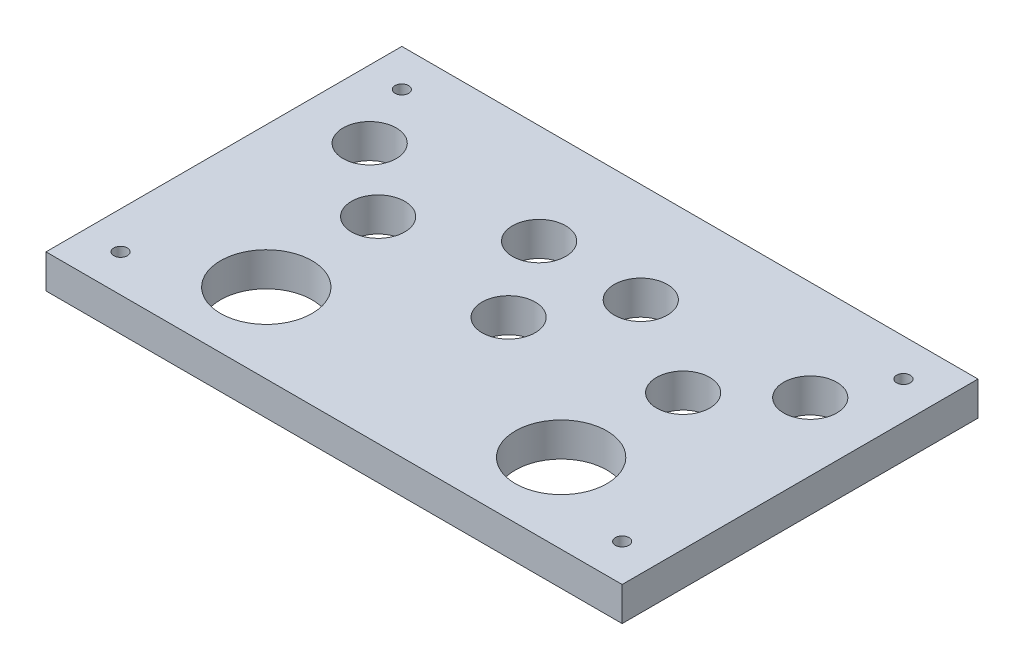
ISO-10303-21;
HEADER;
FILE_DESCRIPTION(('STEP AP214'),'2;1');
FILE_NAME('part.step','',(''),(''),'','','');
FILE_SCHEMA(('AUTOMOTIVE_DESIGN { 1 0 10303 214 1 1 1 1 }'));
ENDSEC;
DATA;
#1=APPLICATION_CONTEXT('core data for automotive mechanical design processes');
#2=APPLICATION_PROTOCOL_DEFINITION('international standard','automotive_design',2000,#1);
#3=PRODUCT_CONTEXT('',#1,'mechanical');
#4=PRODUCT('Part','Part','',(#3));
#5=PRODUCT_RELATED_PRODUCT_CATEGORY('part','',(#4));
#6=PRODUCT_DEFINITION_FORMATION('','',#4);
#7=PRODUCT_DEFINITION_CONTEXT('part definition',#1,'design');
#8=PRODUCT_DEFINITION('design','',#6,#7);
#9=PRODUCT_DEFINITION_SHAPE('','',#8);
#10=(LENGTH_UNIT() NAMED_UNIT(*) SI_UNIT(.MILLI.,.METRE.));
#11=(NAMED_UNIT(*) PLANE_ANGLE_UNIT() SI_UNIT($,.RADIAN.));
#12=(NAMED_UNIT(*) SI_UNIT($,.STERADIAN.) SOLID_ANGLE_UNIT());
#13=UNCERTAINTY_MEASURE_WITH_UNIT(LENGTH_MEASURE(1.E-05),#10,'distance_accuracy_value','');
#14=(GEOMETRIC_REPRESENTATION_CONTEXT(3) GLOBAL_UNCERTAINTY_ASSIGNED_CONTEXT((#13)) GLOBAL_UNIT_ASSIGNED_CONTEXT((#10,
#11,#12)) REPRESENTATION_CONTEXT('',''));
#15=CARTESIAN_POINT('',(0.,0.,0.));
#16=DIRECTION('',(0.,0.,1.));
#17=DIRECTION('',(1.,0.,0.));
#18=AXIS2_PLACEMENT_3D('',#15,#16,#17);
#19=CARTESIAN_POINT('',(0.,10.,0.));
#20=DIRECTION('',(0.,0.,-1.));
#21=DIRECTION('',(-1.,0.,0.));
#22=AXIS2_PLACEMENT_3D('',#19,#20,#21);
#23=PLANE('',#22);
#24=DIRECTION('',(1.,0.,0.));
#25=VECTOR('',#24,1.);
#26=CARTESIAN_POINT('',(0.,0.,0.));
#27=LINE('',#26,#25);
#28=CARTESIAN_POINT('',(0.,0.,0.));
#29=VERTEX_POINT('',#28);
#30=CARTESIAN_POINT('',(170.,0.,0.));
#31=VERTEX_POINT('',#30);
#32=EDGE_CURVE('E139',#29,#31,#27,.T.);
#33=ORIENTED_EDGE('',*,*,#32,.T.);
#34=DIRECTION('',(0.,-1.,0.));
#35=VECTOR('',#34,1.);
#36=CARTESIAN_POINT('',(170.,10.,0.));
#37=LINE('',#36,#35);
#38=CARTESIAN_POINT('',(170.,10.,0.));
#39=VERTEX_POINT('',#38);
#40=EDGE_CURVE('E11',#39,#31,#37,.T.);
#41=ORIENTED_EDGE('',*,*,#40,.F.);
#42=DIRECTION('',(1.,0.,0.));
#43=VECTOR('',#42,1.);
#44=CARTESIAN_POINT('',(0.,10.,0.));
#45=LINE('',#44,#43);
#46=CARTESIAN_POINT('',(0.,10.,0.));
#47=VERTEX_POINT('',#46);
#48=EDGE_CURVE('E86',#47,#39,#45,.T.);
#49=ORIENTED_EDGE('',*,*,#48,.F.);
#50=DIRECTION('',(0.,-1.,0.));
#51=VECTOR('',#50,1.);
#52=CARTESIAN_POINT('',(0.,10.,0.));
#53=LINE('',#52,#51);
#54=EDGE_CURVE('E52',#47,#29,#53,.T.);
#55=ORIENTED_EDGE('',*,*,#54,.T.);
#56=EDGE_LOOP('',(#33,#41,#49,#55));
#57=FACE_BOUND('',#56,.T.);
#58=ADVANCED_FACE('F35',(#57),#23,.F.);
#59=CARTESIAN_POINT('',(170.,10.,0.));
#60=DIRECTION('',(-1.,0.,0.));
#61=DIRECTION('',(0.,0.,1.));
#62=AXIS2_PLACEMENT_3D('',#59,#60,#61);
#63=PLANE('',#62);
#64=DIRECTION('',(0.,0.,-1.));
#65=VECTOR('',#64,1.);
#66=CARTESIAN_POINT('',(170.,0.,0.));
#67=LINE('',#66,#65);
#68=CARTESIAN_POINT('',(170.,0.,-105.));
#69=VERTEX_POINT('',#68);
#70=EDGE_CURVE('E91',#31,#69,#67,.T.);
#71=ORIENTED_EDGE('',*,*,#70,.T.);
#72=DIRECTION('',(0.,-1.,0.));
#73=VECTOR('',#72,1.);
#74=CARTESIAN_POINT('',(170.,10.,-105.));
#75=LINE('',#74,#73);
#76=CARTESIAN_POINT('',(170.,10.,-105.));
#77=VERTEX_POINT('',#76);
#78=EDGE_CURVE('E44',#77,#69,#75,.T.);
#79=ORIENTED_EDGE('',*,*,#78,.F.);
#80=DIRECTION('',(0.,0.,-1.));
#81=VECTOR('',#80,1.);
#82=CARTESIAN_POINT('',(170.,10.,0.));
#83=LINE('',#82,#81);
#84=EDGE_CURVE('E77',#39,#77,#83,.T.);
#85=ORIENTED_EDGE('',*,*,#84,.F.);
#86=ORIENTED_EDGE('',*,*,#40,.T.);
#87=EDGE_LOOP('',(#71,#79,#85,#86));
#88=FACE_BOUND('',#87,.T.);
#89=ADVANCED_FACE('F90',(#88),#63,.F.);
#90=CARTESIAN_POINT('',(0.,10.,-105.));
#91=DIRECTION('',(0.,0.,-1.));
#92=DIRECTION('',(-1.,0.,0.));
#93=AXIS2_PLACEMENT_3D('',#90,#91,#92);
#94=PLANE('',#93);
#95=DIRECTION('',(1.,0.,0.));
#96=VECTOR('',#95,1.);
#97=CARTESIAN_POINT('',(0.,0.,-105.));
#98=LINE('',#97,#96);
#99=CARTESIAN_POINT('',(0.,0.,-105.));
#100=VERTEX_POINT('',#99);
#101=EDGE_CURVE('E142',#100,#69,#98,.T.);
#102=ORIENTED_EDGE('',*,*,#101,.F.);
#103=DIRECTION('',(0.,-1.,0.));
#104=VECTOR('',#103,1.);
#105=CARTESIAN_POINT('',(0.,10.,-105.));
#106=LINE('',#105,#104);
#107=CARTESIAN_POINT('',(0.,10.,-105.));
#108=VERTEX_POINT('',#107);
#109=EDGE_CURVE('E66',#108,#100,#106,.T.);
#110=ORIENTED_EDGE('',*,*,#109,.F.);
#111=DIRECTION('',(1.,0.,0.));
#112=VECTOR('',#111,1.);
#113=CARTESIAN_POINT('',(0.,10.,-105.));
#114=LINE('',#113,#112);
#115=EDGE_CURVE('E85',#108,#77,#114,.T.);
#116=ORIENTED_EDGE('',*,*,#115,.T.);
#117=ORIENTED_EDGE('',*,*,#78,.T.);
#118=EDGE_LOOP('',(#102,#110,#116,#117));
#119=FACE_BOUND('',#118,.T.);
#120=ADVANCED_FACE('F94',(#119),#94,.T.);
#121=CARTESIAN_POINT('',(70.,10.,-75.5));
#122=DIRECTION('',(0.,-1.,0.));
#123=DIRECTION('',(0.,0.,-1.));
#124=AXIS2_PLACEMENT_3D('',#121,#122,#123);
#125=CYLINDRICAL_SURFACE('',#124,7.84999999999999);
#126=CARTESIAN_POINT('',(70.,10.,-75.5));
#127=DIRECTION('',(0.,1.,0.));
#128=DIRECTION('',(0.,0.,1.));
#129=AXIS2_PLACEMENT_3D('',#126,#127,#128);
#130=CIRCLE('',#129,7.84999999999999);
#131=CARTESIAN_POINT('',(70.,10.,-67.65));
#132=VERTEX_POINT('',#131);
#133=EDGE_CURVE('E118',#132,#132,#130,.T.);
#134=ORIENTED_EDGE('',*,*,#133,.T.);
#135=EDGE_LOOP('',(#134));
#136=FACE_BOUND('',#135,.T.);
#137=CARTESIAN_POINT('',(70.,0.,-75.5));
#138=DIRECTION('',(0.,1.,0.));
#139=DIRECTION('',(0.,0.,1.));
#140=AXIS2_PLACEMENT_3D('',#137,#138,#139);
#141=CIRCLE('',#140,7.84999999999999);
#142=CARTESIAN_POINT('',(70.,0.,-67.65));
#143=VERTEX_POINT('',#142);
#144=EDGE_CURVE('E165',#143,#143,#141,.T.);
#145=ORIENTED_EDGE('',*,*,#144,.F.);
#146=EDGE_LOOP('',(#145));
#147=FACE_BOUND('',#146,.T.);
#148=ADVANCED_FACE('F260',(#136,#147),#125,.F.);
#149=CARTESIAN_POINT('',(40.,10.,-58.));
#150=DIRECTION('',(0.,-1.,0.));
#151=DIRECTION('',(0.,0.,-1.));
#152=AXIS2_PLACEMENT_3D('',#149,#150,#151);
#153=CYLINDRICAL_SURFACE('',#152,7.84999999999999);
#154=CARTESIAN_POINT('',(40.,10.,-58.));
#155=DIRECTION('',(0.,1.,0.));
#156=DIRECTION('',(0.,0.,1.));
#157=AXIS2_PLACEMENT_3D('',#154,#155,#156);
#158=CIRCLE('',#157,7.84999999999999);
#159=CARTESIAN_POINT('',(40.,10.,-50.15));
#160=VERTEX_POINT('',#159);
#161=EDGE_CURVE('E115',#160,#160,#158,.T.);
#162=ORIENTED_EDGE('',*,*,#161,.T.);
#163=EDGE_LOOP('',(#162));
#164=FACE_BOUND('',#163,.T.);
#165=CARTESIAN_POINT('',(40.,0.,-58.));
#166=DIRECTION('',(0.,1.,0.));
#167=DIRECTION('',(0.,0.,1.));
#168=AXIS2_PLACEMENT_3D('',#165,#166,#167);
#169=CIRCLE('',#168,7.84999999999999);
#170=CARTESIAN_POINT('',(40.,0.,-50.15));
#171=VERTEX_POINT('',#170);
#172=EDGE_CURVE('E162',#171,#171,#169,.T.);
#173=ORIENTED_EDGE('',*,*,#172,.F.);
#174=EDGE_LOOP('',(#173));
#175=FACE_BOUND('',#174,.T.);
#176=ADVANCED_FACE('F262',(#164,#175),#153,.F.);
#177=CARTESIAN_POINT('',(20.,10.,-75.5));
#178=DIRECTION('',(0.,-1.,0.));
#179=DIRECTION('',(0.,0.,-1.));
#180=AXIS2_PLACEMENT_3D('',#177,#178,#179);
#181=CYLINDRICAL_SURFACE('',#180,7.85);
#182=CARTESIAN_POINT('',(20.,10.,-75.5));
#183=DIRECTION('',(0.,1.,0.));
#184=DIRECTION('',(0.,0.,1.));
#185=AXIS2_PLACEMENT_3D('',#182,#183,#184);
#186=CIRCLE('',#185,7.85);
#187=CARTESIAN_POINT('',(20.,10.,-67.65));
#188=VERTEX_POINT('',#187);
#189=EDGE_CURVE('E112',#188,#188,#186,.T.);
#190=ORIENTED_EDGE('',*,*,#189,.T.);
#191=EDGE_LOOP('',(#190));
#192=FACE_BOUND('',#191,.T.);
#193=CARTESIAN_POINT('',(20.,0.,-75.5));
#194=DIRECTION('',(0.,1.,0.));
#195=DIRECTION('',(0.,0.,1.));
#196=AXIS2_PLACEMENT_3D('',#193,#194,#195);
#197=CIRCLE('',#196,7.85);
#198=CARTESIAN_POINT('',(20.,0.,-67.65));
#199=VERTEX_POINT('',#198);
#200=EDGE_CURVE('E159',#199,#199,#197,.T.);
#201=ORIENTED_EDGE('',*,*,#200,.F.);
#202=EDGE_LOOP('',(#201));
#203=FACE_BOUND('',#202,.T.);
#204=ADVANCED_FACE('F269',(#192,#203),#181,.F.);
#205=CARTESIAN_POINT('',(100.,10.,-75.5));
#206=DIRECTION('',(0.,-1.,0.));
#207=DIRECTION('',(0.,0.,-1.));
#208=AXIS2_PLACEMENT_3D('',#205,#206,#207);
#209=CYLINDRICAL_SURFACE('',#208,7.84999999999999);
#210=CARTESIAN_POINT('',(100.,10.,-75.5));
#211=DIRECTION('',(0.,1.,0.));
#212=DIRECTION('',(0.,0.,1.));
#213=AXIS2_PLACEMENT_3D('',#210,#211,#212);
#214=CIRCLE('',#213,7.84999999999999);
#215=CARTESIAN_POINT('',(100.,10.,-67.65));
#216=VERTEX_POINT('',#215);
#217=EDGE_CURVE('E109',#216,#216,#214,.F.);
#218=ORIENTED_EDGE('',*,*,#217,.F.);
#219=EDGE_LOOP('',(#218));
#220=FACE_BOUND('',#219,.T.);
#221=CARTESIAN_POINT('',(100.,0.,-75.5));
#222=DIRECTION('',(0.,1.,0.));
#223=DIRECTION('',(0.,0.,1.));
#224=AXIS2_PLACEMENT_3D('',#221,#222,#223);
#225=CIRCLE('',#224,7.84999999999999);
#226=CARTESIAN_POINT('',(100.,0.,-67.65));
#227=VERTEX_POINT('',#226);
#228=EDGE_CURVE('E156',#227,#227,#225,.F.);
#229=ORIENTED_EDGE('',*,*,#228,.T.);
#230=EDGE_LOOP('',(#229));
#231=FACE_BOUND('',#230,.T.);
#232=ADVANCED_FACE('F275',(#220,#231),#209,.F.);
#233=CARTESIAN_POINT('',(150.,10.,-75.5));
#234=DIRECTION('',(0.,-1.,0.));
#235=DIRECTION('',(0.,0.,-1.));
#236=AXIS2_PLACEMENT_3D('',#233,#234,#235);
#237=CYLINDRICAL_SURFACE('',#236,7.84999999999997);
#238=CARTESIAN_POINT('',(150.,10.,-75.5));
#239=DIRECTION('',(0.,1.,0.));
#240=DIRECTION('',(0.,0.,1.));
#241=AXIS2_PLACEMENT_3D('',#238,#239,#240);
#242=CIRCLE('',#241,7.84999999999997);
#243=CARTESIAN_POINT('',(150.,10.,-67.65));
#244=VERTEX_POINT('',#243);
#245=EDGE_CURVE('E106',#244,#244,#242,.F.);
#246=ORIENTED_EDGE('',*,*,#245,.F.);
#247=EDGE_LOOP('',(#246));
#248=FACE_BOUND('',#247,.T.);
#249=CARTESIAN_POINT('',(150.,0.,-75.5));
#250=DIRECTION('',(0.,1.,0.));
#251=DIRECTION('',(0.,0.,1.));
#252=AXIS2_PLACEMENT_3D('',#249,#250,#251);
#253=CIRCLE('',#252,7.84999999999997);
#254=CARTESIAN_POINT('',(150.,0.,-67.65));
#255=VERTEX_POINT('',#254);
#256=EDGE_CURVE('E153',#255,#255,#253,.F.);
#257=ORIENTED_EDGE('',*,*,#256,.T.);
#258=EDGE_LOOP('',(#257));
#259=FACE_BOUND('',#258,.T.);
#260=ADVANCED_FACE('F279',(#248,#259),#237,.F.);
#261=CARTESIAN_POINT('',(159.,10.,-94.));
#262=DIRECTION('',(0.,-1.,0.));
#263=DIRECTION('',(0.,0.,-1.));
#264=AXIS2_PLACEMENT_3D('',#261,#262,#263);
#265=CYLINDRICAL_SURFACE('',#264,2.);
#266=CARTESIAN_POINT('',(159.,10.,-94.));
#267=DIRECTION('',(0.,1.,0.));
#268=DIRECTION('',(0.,0.,1.));
#269=AXIS2_PLACEMENT_3D('',#266,#267,#268);
#270=CIRCLE('',#269,2.);
#271=CARTESIAN_POINT('',(159.,10.,-92.));
#272=VERTEX_POINT('',#271);
#273=EDGE_CURVE('E103',#272,#272,#270,.F.);
#274=ORIENTED_EDGE('',*,*,#273,.F.);
#275=EDGE_LOOP('',(#274));
#276=FACE_BOUND('',#275,.T.);
#277=CARTESIAN_POINT('',(159.,0.,-94.));
#278=DIRECTION('',(0.,1.,0.));
#279=DIRECTION('',(0.,0.,1.));
#280=AXIS2_PLACEMENT_3D('',#277,#278,#279);
#281=CIRCLE('',#280,2.);
#282=CARTESIAN_POINT('',(159.,0.,-92.));
#283=VERTEX_POINT('',#282);
#284=EDGE_CURVE('E150',#283,#283,#281,.F.);
#285=ORIENTED_EDGE('',*,*,#284,.T.);
#286=EDGE_LOOP('',(#285));
#287=FACE_BOUND('',#286,.T.);
#288=ADVANCED_FACE('F283',(#276,#287),#265,.F.);
#289=CARTESIAN_POINT('',(159.,10.,-11.));
#290=DIRECTION('',(0.,-1.,0.));
#291=DIRECTION('',(0.,0.,-1.));
#292=AXIS2_PLACEMENT_3D('',#289,#290,#291);
#293=CYLINDRICAL_SURFACE('',#292,2.);
#294=CARTESIAN_POINT('',(159.,10.,-11.));
#295=DIRECTION('',(0.,1.,0.));
#296=DIRECTION('',(0.,0.,1.));
#297=AXIS2_PLACEMENT_3D('',#294,#295,#296);
#298=CIRCLE('',#297,2.);
#299=CARTESIAN_POINT('',(159.,10.,-9.00000000000003));
#300=VERTEX_POINT('',#299);
#301=EDGE_CURVE('E97',#300,#300,#298,.T.);
#302=ORIENTED_EDGE('',*,*,#301,.T.);
#303=EDGE_LOOP('',(#302));
#304=FACE_BOUND('',#303,.T.);
#305=CARTESIAN_POINT('',(159.,0.,-11.));
#306=DIRECTION('',(0.,1.,0.));
#307=DIRECTION('',(0.,0.,1.));
#308=AXIS2_PLACEMENT_3D('',#305,#306,#307);
#309=CIRCLE('',#308,2.);
#310=CARTESIAN_POINT('',(159.,0.,-9.00000000000003));
#311=VERTEX_POINT('',#310);
#312=EDGE_CURVE('E147',#311,#311,#309,.T.);
#313=ORIENTED_EDGE('',*,*,#312,.F.);
#314=EDGE_LOOP('',(#313));
#315=FACE_BOUND('',#314,.T.);
#316=ADVANCED_FACE('F287',(#304,#315),#293,.F.);
#317=CARTESIAN_POINT('',(0.,10.,0.));
#318=DIRECTION('',(-1.,0.,0.));
#319=DIRECTION('',(0.,0.,1.));
#320=AXIS2_PLACEMENT_3D('',#317,#318,#319);
#321=PLANE('',#320);
#322=DIRECTION('',(0.,0.,-1.));
#323=VECTOR('',#322,1.);
#324=CARTESIAN_POINT('',(0.,0.,0.));
#325=LINE('',#324,#323);
#326=EDGE_CURVE('E144',#29,#100,#325,.T.);
#327=ORIENTED_EDGE('',*,*,#326,.F.);
#328=ORIENTED_EDGE('',*,*,#54,.F.);
#329=DIRECTION('',(0.,0.,-1.));
#330=VECTOR('',#329,1.);
#331=CARTESIAN_POINT('',(0.,10.,0.));
#332=LINE('',#331,#330);
#333=EDGE_CURVE('E95',#47,#108,#332,.T.);
#334=ORIENTED_EDGE('',*,*,#333,.T.);
#335=ORIENTED_EDGE('',*,*,#109,.T.);
#336=EDGE_LOOP('',(#327,#328,#334,#335));
#337=FACE_BOUND('',#336,.T.);
#338=ADVANCED_FACE('F221',(#337),#321,.T.);
#339=CARTESIAN_POINT('',(11.,10.,-94.));
#340=DIRECTION('',(0.,-1.,0.));
#341=DIRECTION('',(0.,0.,-1.));
#342=AXIS2_PLACEMENT_3D('',#339,#340,#341);
#343=CYLINDRICAL_SURFACE('',#342,2.);
#344=CARTESIAN_POINT('',(11.,10.,-94.));
#345=DIRECTION('',(0.,1.,0.));
#346=DIRECTION('',(0.,0.,1.));
#347=AXIS2_PLACEMENT_3D('',#344,#345,#346);
#348=CIRCLE('',#347,2.);
#349=CARTESIAN_POINT('',(11.,10.,-92.));
#350=VERTEX_POINT('',#349);
#351=EDGE_CURVE('E189',#350,#350,#348,.T.);
#352=ORIENTED_EDGE('',*,*,#351,.T.);
#353=EDGE_LOOP('',(#352));
#354=FACE_BOUND('',#353,.T.);
#355=CARTESIAN_POINT('',(11.,0.,-94.));
#356=DIRECTION('',(0.,1.,0.));
#357=DIRECTION('',(0.,0.,1.));
#358=AXIS2_PLACEMENT_3D('',#355,#356,#357);
#359=CIRCLE('',#358,2.);
#360=CARTESIAN_POINT('',(11.,0.,-92.));
#361=VERTEX_POINT('',#360);
#362=EDGE_CURVE('E136',#361,#361,#359,.T.);
#363=ORIENTED_EDGE('',*,*,#362,.F.);
#364=EDGE_LOOP('',(#363));
#365=FACE_BOUND('',#364,.T.);
#366=ADVANCED_FACE('F193',(#354,#365),#343,.F.);
#367=CARTESIAN_POINT('',(11.,10.,-11.));
#368=DIRECTION('',(0.,-1.,0.));
#369=DIRECTION('',(0.,0.,-1.));
#370=AXIS2_PLACEMENT_3D('',#367,#368,#369);
#371=CYLINDRICAL_SURFACE('',#370,2.);
#372=CARTESIAN_POINT('',(11.,10.,-11.));
#373=DIRECTION('',(0.,1.,0.));
#374=DIRECTION('',(0.,0.,1.));
#375=AXIS2_PLACEMENT_3D('',#372,#373,#374);
#376=CIRCLE('',#375,2.);
#377=CARTESIAN_POINT('',(11.,10.,-9.));
#378=VERTEX_POINT('',#377);
#379=EDGE_CURVE('E186',#378,#378,#376,.F.);
#380=ORIENTED_EDGE('',*,*,#379,.F.);
#381=EDGE_LOOP('',(#380));
#382=FACE_BOUND('',#381,.T.);
#383=CARTESIAN_POINT('',(11.,0.,-11.));
#384=DIRECTION('',(0.,1.,0.));
#385=DIRECTION('',(0.,0.,1.));
#386=AXIS2_PLACEMENT_3D('',#383,#384,#385);
#387=CIRCLE('',#386,2.);
#388=CARTESIAN_POINT('',(11.,0.,-9.));
#389=VERTEX_POINT('',#388);
#390=EDGE_CURVE('E133',#389,#389,#387,.F.);
#391=ORIENTED_EDGE('',*,*,#390,.T.);
#392=EDGE_LOOP('',(#391));
#393=FACE_BOUND('',#392,.T.);
#394=ADVANCED_FACE('F220',(#382,#393),#371,.F.);
#395=CARTESIAN_POINT('',(130.,10.,-58.));
#396=DIRECTION('',(0.,-1.,0.));
#397=DIRECTION('',(0.,0.,-1.));
#398=AXIS2_PLACEMENT_3D('',#395,#396,#397);
#399=CYLINDRICAL_SURFACE('',#398,7.84999999999998);
#400=CARTESIAN_POINT('',(130.,10.,-58.));
#401=DIRECTION('',(0.,1.,0.));
#402=DIRECTION('',(0.,0.,1.));
#403=AXIS2_PLACEMENT_3D('',#400,#401,#402);
#404=CIRCLE('',#403,7.84999999999998);
#405=CARTESIAN_POINT('',(130.,10.,-50.15));
#406=VERTEX_POINT('',#405);
#407=EDGE_CURVE('E181',#406,#406,#404,.F.);
#408=ORIENTED_EDGE('',*,*,#407,.F.);
#409=EDGE_LOOP('',(#408));
#410=FACE_BOUND('',#409,.T.);
#411=CARTESIAN_POINT('',(130.,0.,-58.));
#412=DIRECTION('',(0.,1.,0.));
#413=DIRECTION('',(0.,0.,1.));
#414=AXIS2_PLACEMENT_3D('',#411,#412,#413);
#415=CIRCLE('',#414,7.84999999999998);
#416=CARTESIAN_POINT('',(130.,0.,-50.15));
#417=VERTEX_POINT('',#416);
#418=EDGE_CURVE('E130',#417,#417,#415,.F.);
#419=ORIENTED_EDGE('',*,*,#418,.T.);
#420=EDGE_LOOP('',(#419));
#421=FACE_BOUND('',#420,.T.);
#422=ADVANCED_FACE('F224',(#410,#421),#399,.F.);
#423=CARTESIAN_POINT('',(41.5,10.,-23.5));
#424=DIRECTION('',(0.,-1.,0.));
#425=DIRECTION('',(0.,0.,-1.));
#426=AXIS2_PLACEMENT_3D('',#423,#424,#425);
#427=CYLINDRICAL_SURFACE('',#426,13.5);
#428=CARTESIAN_POINT('',(41.5,10.,-23.5));
#429=DIRECTION('',(0.,1.,0.));
#430=DIRECTION('',(0.,0.,1.));
#431=AXIS2_PLACEMENT_3D('',#428,#429,#430);
#432=CIRCLE('',#431,13.5);
#433=CARTESIAN_POINT('',(41.5,10.,-10.));
#434=VERTEX_POINT('',#433);
#435=EDGE_CURVE('E176',#434,#434,#432,.T.);
#436=ORIENTED_EDGE('',*,*,#435,.T.);
#437=EDGE_LOOP('',(#436));
#438=FACE_BOUND('',#437,.T.);
#439=CARTESIAN_POINT('',(41.5,0.,-23.5));
#440=DIRECTION('',(0.,1.,0.));
#441=DIRECTION('',(0.,0.,1.));
#442=AXIS2_PLACEMENT_3D('',#439,#440,#441);
#443=CIRCLE('',#442,13.5);
#444=CARTESIAN_POINT('',(41.5,0.,-10.));
#445=VERTEX_POINT('',#444);
#446=EDGE_CURVE('E127',#445,#445,#443,.T.);
#447=ORIENTED_EDGE('',*,*,#446,.F.);
#448=EDGE_LOOP('',(#447));
#449=FACE_BOUND('',#448,.T.);
#450=ADVANCED_FACE('F227',(#438,#449),#427,.F.);
#451=CARTESIAN_POINT('',(128.5,10.,-23.5));
#452=DIRECTION('',(0.,-1.,0.));
#453=DIRECTION('',(0.,0.,-1.));
#454=AXIS2_PLACEMENT_3D('',#451,#452,#453);
#455=CYLINDRICAL_SURFACE('',#454,13.5);
#456=CARTESIAN_POINT('',(128.5,10.,-23.5));
#457=DIRECTION('',(0.,1.,0.));
#458=DIRECTION('',(0.,0.,1.));
#459=AXIS2_PLACEMENT_3D('',#456,#457,#458);
#460=CIRCLE('',#459,13.5);
#461=CARTESIAN_POINT('',(128.5,10.,-10.));
#462=VERTEX_POINT('',#461);
#463=EDGE_CURVE('E171',#462,#462,#460,.T.);
#464=ORIENTED_EDGE('',*,*,#463,.T.);
#465=EDGE_LOOP('',(#464));
#466=FACE_BOUND('',#465,.T.);
#467=CARTESIAN_POINT('',(128.5,0.,-23.5));
#468=DIRECTION('',(0.,1.,0.));
#469=DIRECTION('',(0.,0.,1.));
#470=AXIS2_PLACEMENT_3D('',#467,#468,#469);
#471=CIRCLE('',#470,13.5);
#472=CARTESIAN_POINT('',(128.5,0.,-10.));
#473=VERTEX_POINT('',#472);
#474=EDGE_CURVE('E124',#473,#473,#471,.T.);
#475=ORIENTED_EDGE('',*,*,#474,.F.);
#476=EDGE_LOOP('',(#475));
#477=FACE_BOUND('',#476,.T.);
#478=ADVANCED_FACE('F37',(#466,#477),#455,.F.);
#479=CARTESIAN_POINT('',(85.,10.,-51.5));
#480=DIRECTION('',(0.,-1.,0.));
#481=DIRECTION('',(0.,0.,-1.));
#482=AXIS2_PLACEMENT_3D('',#479,#480,#481);
#483=CYLINDRICAL_SURFACE('',#482,7.84999999999999);
#484=CARTESIAN_POINT('',(85.,10.,-51.5));
#485=DIRECTION('',(0.,1.,0.));
#486=DIRECTION('',(0.,0.,1.));
#487=AXIS2_PLACEMENT_3D('',#484,#485,#486);
#488=CIRCLE('',#487,7.84999999999999);
#489=CARTESIAN_POINT('',(85.,10.,-43.65));
#490=VERTEX_POINT('',#489);
#491=EDGE_CURVE('E121',#490,#490,#488,.T.);
#492=ORIENTED_EDGE('',*,*,#491,.T.);
#493=EDGE_LOOP('',(#492));
#494=FACE_BOUND('',#493,.T.);
#495=CARTESIAN_POINT('',(85.,0.,-51.5));
#496=DIRECTION('',(0.,1.,0.));
#497=DIRECTION('',(0.,0.,1.));
#498=AXIS2_PLACEMENT_3D('',#495,#496,#497);
#499=CIRCLE('',#498,7.84999999999999);
#500=CARTESIAN_POINT('',(85.,0.,-43.65));
#501=VERTEX_POINT('',#500);
#502=EDGE_CURVE('E168',#501,#501,#499,.T.);
#503=ORIENTED_EDGE('',*,*,#502,.F.);
#504=EDGE_LOOP('',(#503));
#505=FACE_BOUND('',#504,.T.);
#506=ADVANCED_FACE('F198',(#494,#505),#483,.F.);
#507=CARTESIAN_POINT('',(0.,10.,0.));
#508=DIRECTION('',(0.,1.,0.));
#509=DIRECTION('',(0.,0.,1.));
#510=AXIS2_PLACEMENT_3D('',#507,#508,#509);
#511=PLANE('',#510);
#512=ORIENTED_EDGE('',*,*,#463,.F.);
#513=EDGE_LOOP('',(#512));
#514=FACE_BOUND('',#513,.T.);
#515=ORIENTED_EDGE('',*,*,#435,.F.);
#516=EDGE_LOOP('',(#515));
#517=FACE_BOUND('',#516,.T.);
#518=ORIENTED_EDGE('',*,*,#407,.T.);
#519=EDGE_LOOP('',(#518));
#520=FACE_BOUND('',#519,.T.);
#521=ORIENTED_EDGE('',*,*,#379,.T.);
#522=EDGE_LOOP('',(#521));
#523=FACE_BOUND('',#522,.T.);
#524=ORIENTED_EDGE('',*,*,#351,.F.);
#525=EDGE_LOOP('',(#524));
#526=FACE_BOUND('',#525,.T.);
#527=ORIENTED_EDGE('',*,*,#48,.T.);
#528=ORIENTED_EDGE('',*,*,#84,.T.);
#529=ORIENTED_EDGE('',*,*,#115,.F.);
#530=ORIENTED_EDGE('',*,*,#333,.F.);
#531=EDGE_LOOP('',(#527,#528,#529,#530));
#532=FACE_BOUND('',#531,.T.);
#533=ORIENTED_EDGE('',*,*,#301,.F.);
#534=EDGE_LOOP('',(#533));
#535=FACE_BOUND('',#534,.T.);
#536=ORIENTED_EDGE('',*,*,#273,.T.);
#537=EDGE_LOOP('',(#536));
#538=FACE_BOUND('',#537,.T.);
#539=ORIENTED_EDGE('',*,*,#245,.T.);
#540=EDGE_LOOP('',(#539));
#541=FACE_BOUND('',#540,.T.);
#542=ORIENTED_EDGE('',*,*,#217,.T.);
#543=EDGE_LOOP('',(#542));
#544=FACE_BOUND('',#543,.T.);
#545=ORIENTED_EDGE('',*,*,#189,.F.);
#546=EDGE_LOOP('',(#545));
#547=FACE_BOUND('',#546,.T.);
#548=ORIENTED_EDGE('',*,*,#161,.F.);
#549=EDGE_LOOP('',(#548));
#550=FACE_BOUND('',#549,.T.);
#551=ORIENTED_EDGE('',*,*,#133,.F.);
#552=EDGE_LOOP('',(#551));
#553=FACE_BOUND('',#552,.T.);
#554=ORIENTED_EDGE('',*,*,#491,.F.);
#555=EDGE_LOOP('',(#554));
#556=FACE_BOUND('',#555,.T.);
#557=ADVANCED_FACE('F81',(#514,#517,#520,#523,#526,#532,#535,#538,#541,#544,#547,#550,#553,
#556),#511,.T.);
#558=CARTESIAN_POINT('',(0.,0.,0.));
#559=DIRECTION('',(0.,1.,0.));
#560=DIRECTION('',(0.,0.,1.));
#561=AXIS2_PLACEMENT_3D('',#558,#559,#560);
#562=PLANE('',#561);
#563=ORIENTED_EDGE('',*,*,#474,.T.);
#564=EDGE_LOOP('',(#563));
#565=FACE_BOUND('',#564,.T.);
#566=ORIENTED_EDGE('',*,*,#446,.T.);
#567=EDGE_LOOP('',(#566));
#568=FACE_BOUND('',#567,.T.);
#569=ORIENTED_EDGE('',*,*,#418,.F.);
#570=EDGE_LOOP('',(#569));
#571=FACE_BOUND('',#570,.T.);
#572=ORIENTED_EDGE('',*,*,#390,.F.);
#573=EDGE_LOOP('',(#572));
#574=FACE_BOUND('',#573,.T.);
#575=ORIENTED_EDGE('',*,*,#362,.T.);
#576=EDGE_LOOP('',(#575));
#577=FACE_BOUND('',#576,.T.);
#578=ORIENTED_EDGE('',*,*,#32,.F.);
#579=ORIENTED_EDGE('',*,*,#326,.T.);
#580=ORIENTED_EDGE('',*,*,#101,.T.);
#581=ORIENTED_EDGE('',*,*,#70,.F.);
#582=EDGE_LOOP('',(#578,#579,#580,#581));
#583=FACE_BOUND('',#582,.T.);
#584=ORIENTED_EDGE('',*,*,#312,.T.);
#585=EDGE_LOOP('',(#584));
#586=FACE_BOUND('',#585,.T.);
#587=ORIENTED_EDGE('',*,*,#284,.F.);
#588=EDGE_LOOP('',(#587));
#589=FACE_BOUND('',#588,.T.);
#590=ORIENTED_EDGE('',*,*,#256,.F.);
#591=EDGE_LOOP('',(#590));
#592=FACE_BOUND('',#591,.T.);
#593=ORIENTED_EDGE('',*,*,#228,.F.);
#594=EDGE_LOOP('',(#593));
#595=FACE_BOUND('',#594,.T.);
#596=ORIENTED_EDGE('',*,*,#200,.T.);
#597=EDGE_LOOP('',(#596));
#598=FACE_BOUND('',#597,.T.);
#599=ORIENTED_EDGE('',*,*,#172,.T.);
#600=EDGE_LOOP('',(#599));
#601=FACE_BOUND('',#600,.T.);
#602=ORIENTED_EDGE('',*,*,#144,.T.);
#603=EDGE_LOOP('',(#602));
#604=FACE_BOUND('',#603,.T.);
#605=ORIENTED_EDGE('',*,*,#502,.T.);
#606=EDGE_LOOP('',(#605));
#607=FACE_BOUND('',#606,.T.);
#608=ADVANCED_FACE('F197',(#565,#568,#571,#574,#577,#583,#586,#589,#592,#595,#598,#601,#604,
#607),#562,.F.);
#609=CLOSED_SHELL('',(#58,#89,#120,#148,#176,#204,#232,#260,#288,#316,#338,#366,#394,#422,#450,
#478,#506,#557,#608));
#610=MANIFOLD_SOLID_BREP('B2',#609);
#611=ADVANCED_BREP_SHAPE_REPRESENTATION('',(#18,#610),#14);
#612=SHAPE_DEFINITION_REPRESENTATION(#9,#611);
ENDSEC;
END-ISO-10303-21;
